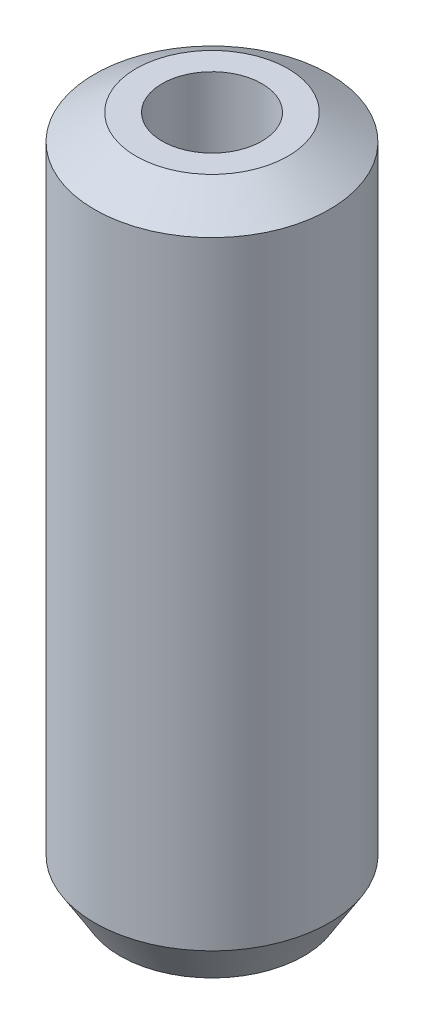
ISO-10303-21;
HEADER;
FILE_DESCRIPTION(('STEP AP214'),'2;1');
FILE_NAME('part.step','',(''),(''),'','','');
FILE_SCHEMA(('AUTOMOTIVE_DESIGN { 1 0 10303 214 1 1 1 1 }'));
ENDSEC;
DATA;
#1=APPLICATION_CONTEXT('core data for automotive mechanical design processes');
#2=APPLICATION_PROTOCOL_DEFINITION('international standard','automotive_design',2000,#1);
#3=PRODUCT_CONTEXT('',#1,'mechanical');
#4=PRODUCT('Part','Part','',(#3));
#5=PRODUCT_RELATED_PRODUCT_CATEGORY('part','',(#4));
#6=PRODUCT_DEFINITION_FORMATION('','',#4);
#7=PRODUCT_DEFINITION_CONTEXT('part definition',#1,'design');
#8=PRODUCT_DEFINITION('design','',#6,#7);
#9=PRODUCT_DEFINITION_SHAPE('','',#8);
#10=(LENGTH_UNIT() NAMED_UNIT(*) SI_UNIT(.MILLI.,.METRE.));
#11=(NAMED_UNIT(*) PLANE_ANGLE_UNIT() SI_UNIT($,.RADIAN.));
#12=(NAMED_UNIT(*) SI_UNIT($,.STERADIAN.) SOLID_ANGLE_UNIT());
#13=UNCERTAINTY_MEASURE_WITH_UNIT(LENGTH_MEASURE(1.E-05),#10,'distance_accuracy_value','');
#14=(GEOMETRIC_REPRESENTATION_CONTEXT(3) GLOBAL_UNCERTAINTY_ASSIGNED_CONTEXT((#13)) GLOBAL_UNIT_ASSIGNED_CONTEXT((#10,
#11,#12)) REPRESENTATION_CONTEXT('',''));
#15=CARTESIAN_POINT('',(0.,0.,0.));
#16=DIRECTION('',(0.,0.,1.));
#17=DIRECTION('',(1.,0.,0.));
#18=AXIS2_PLACEMENT_3D('',#15,#16,#17);
#19=CARTESIAN_POINT('',(0.,29.1641394386949,0.));
#20=DIRECTION('',(0.,-1.,0.));
#21=DIRECTION('',(0.,0.,-1.));
#22=AXIS2_PLACEMENT_3D('',#19,#20,#21);
#23=CYLINDRICAL_SURFACE('',#22,5.);
#24=CARTESIAN_POINT('',(0.,28.0793509885658,0.));
#25=DIRECTION('',(0.,1.,0.));
#26=DIRECTION('',(0.,0.,1.));
#27=AXIS2_PLACEMENT_3D('',#24,#25,#26);
#28=CIRCLE('',#27,5.);
#29=CARTESIAN_POINT('',(0.,28.0793509885658,-5.));
#30=VERTEX_POINT('',#29);
#31=EDGE_CURVE('E50',#30,#30,#28,.F.);
#32=CARTESIAN_POINT('',(0.,1.76536457793695,0.));
#33=DIRECTION('',(0.,1.,0.));
#34=DIRECTION('',(0.,0.,1.));
#35=AXIS2_PLACEMENT_3D('',#32,#33,#34);
#36=CIRCLE('',#35,5.);
#37=CARTESIAN_POINT('',(0.,1.76536457793694,-5.));
#38=VERTEX_POINT('',#37);
#39=EDGE_CURVE('E51',#38,#38,#36,.T.);
#40=CARTESIAN_POINT('',(0.,28.0793509885658,-5.));
#41=CARTESIAN_POINT('',(0.,27.8052469634551,-5.));
#42=CARTESIAN_POINT('',(0.,27.5311429383444,-5.));
#43=CARTESIAN_POINT('',(0.,26.982934888123,-5.));
#44=CARTESIAN_POINT('',(0.,26.7088308630122,-5.));
#45=CARTESIAN_POINT('',(0.,26.1606228127908,-5.));
#46=CARTESIAN_POINT('',(0.,25.8865187876801,-5.));
#47=CARTESIAN_POINT('',(0.,25.3383107374586,-5.));
#48=CARTESIAN_POINT('',(0.,25.0642067123479,-5.));
#49=CARTESIAN_POINT('',(0.,24.5159986621265,-5.));
#50=CARTESIAN_POINT('',(0.,24.2418946370158,-5.));
#51=CARTESIAN_POINT('',(0.,23.6936865867943,-5.));
#52=CARTESIAN_POINT('',(0.,23.4195825616836,-5.));
#53=CARTESIAN_POINT('',(0.,22.8713745114622,-5.));
#54=CARTESIAN_POINT('',(0.,22.5972704863515,-5.));
#55=CARTESIAN_POINT('',(0.,22.04906243613,-5.));
#56=CARTESIAN_POINT('',(0.,21.7749584110193,-5.));
#57=CARTESIAN_POINT('',(0.,21.2267503607979,-5.));
#58=CARTESIAN_POINT('',(0.,20.9526463356872,-5.));
#59=CARTESIAN_POINT('',(0.,20.4044382854657,-5.));
#60=CARTESIAN_POINT('',(0.,20.130334260355,-5.));
#61=CARTESIAN_POINT('',(0.,19.5821262101336,-5.));
#62=CARTESIAN_POINT('',(0.,19.3080221850229,-5.));
#63=CARTESIAN_POINT('',(0.,18.7598141348014,-5.));
#64=CARTESIAN_POINT('',(0.,18.4857101096907,-5.));
#65=CARTESIAN_POINT('',(0.,17.9375020594693,-5.));
#66=CARTESIAN_POINT('',(0.,17.6633980343586,-5.));
#67=CARTESIAN_POINT('',(0.,17.1151899841371,-5.));
#68=CARTESIAN_POINT('',(0.,16.8410859590264,-5.));
#69=CARTESIAN_POINT('',(0.,16.292877908805,-5.));
#70=CARTESIAN_POINT('',(0.,16.0187738836943,-5.));
#71=CARTESIAN_POINT('',(0.,15.4705658334728,-5.));
#72=CARTESIAN_POINT('',(0.,15.1964618083621,-5.));
#73=CARTESIAN_POINT('',(0.,14.6482537581407,-5.));
#74=CARTESIAN_POINT('',(0.,14.37414973303,-5.));
#75=CARTESIAN_POINT('',(0.,13.8259416828085,-5.));
#76=CARTESIAN_POINT('',(0.,13.5518376576978,-5.));
#77=CARTESIAN_POINT('',(0.,13.0036296074764,-5.));
#78=CARTESIAN_POINT('',(0.,12.7295255823656,-5.));
#79=CARTESIAN_POINT('',(0.,12.1813175321442,-5.));
#80=CARTESIAN_POINT('',(0.,11.9072135070335,-5.));
#81=CARTESIAN_POINT('',(0.,11.3590054568121,-5.));
#82=CARTESIAN_POINT('',(0.,11.0849014317013,-5.));
#83=CARTESIAN_POINT('',(0.,10.5366933814799,-5.));
#84=CARTESIAN_POINT('',(0.,10.2625893563692,-5.));
#85=CARTESIAN_POINT('',(0.,9.71438130614776,-5.));
#86=CARTESIAN_POINT('',(0.,9.44027728103704,-5.));
#87=CARTESIAN_POINT('',(0.,8.8920692308156,-5.));
#88=CARTESIAN_POINT('',(0.,8.61796520570488,-5.));
#89=CARTESIAN_POINT('',(0.,8.06975715548345,-5.));
#90=CARTESIAN_POINT('',(0.,7.79565313037273,-5.));
#91=CARTESIAN_POINT('',(0.,7.24744508015129,-5.));
#92=CARTESIAN_POINT('',(0.,6.97334105504058,-5.));
#93=CARTESIAN_POINT('',(0.,6.42513300481914,-5.));
#94=CARTESIAN_POINT('',(0.,6.15102897970842,-5.));
#95=CARTESIAN_POINT('',(0.,5.60282092948699,-5.));
#96=CARTESIAN_POINT('',(0.,5.32871690437627,-5.));
#97=CARTESIAN_POINT('',(0.,4.78050885415484,-5.));
#98=CARTESIAN_POINT('',(0.,4.50640482904412,-5.));
#99=CARTESIAN_POINT('',(0.,3.95819677882269,-5.));
#100=CARTESIAN_POINT('',(0.,3.68409275371197,-5.));
#101=CARTESIAN_POINT('',(0.,3.13588470349053,-5.));
#102=CARTESIAN_POINT('',(0.,2.86178067837982,-5.));
#103=CARTESIAN_POINT('',(0.,2.31357262815838,-5.));
#104=CARTESIAN_POINT('',(0.,2.03946860304766,-5.));
#105=CARTESIAN_POINT('',(0.,1.76536457793694,-5.));
#106=B_SPLINE_CURVE_WITH_KNOTS('',3,(#40,#41,#42,#43,#44,#45,#46,#47,#48,#49,#50,#51,#52,#53,
#54,#55,#56,#57,#58,#59,#60,#61,#62,#63,#64,#65,#66,#67,#68,#69,#70,#71,#72,#73,#74,#75,#76,#77,
#78,#79,#80,#81,#82,#83,#84,#85,#86,#87,#88,#89,#90,#91,#92,#93,#94,#95,#96,#97,#98,#99,#100,
#101,#102,#103,#104,#105),.UNSPECIFIED.,.F.,.F.,(4,2,2,2,2,2,2,2,2,2,2,2,2,2,2,2,2,2,2,2,2,2,2,
2,2,2,2,2,2,2,2,2,4),(0.,0.822312075332152,1.64462415066431,2.46693622599646,3.28924830132861,
4.11156037666076,4.93387245199292,5.75618452732507,6.57849660265722,7.40080867798937,
8.22312075332153,9.04543282865368,9.86774490398583,10.690056979318,11.5123690546501,
12.3346811299823,13.1569932053144,13.9793052806466,14.8016173559787,15.6239294313109,
16.446241506643,17.2685535819752,18.0908656573074,18.9131777326395,19.7354898079717,
20.5578018833038,21.380113958636,22.2024260339681,23.0247381093003,23.8470501846324,
24.6693622599646,25.4916743352967,26.3139864106289),.UNSPECIFIED.);
#107=EDGE_CURVE('BSEAM39',#30,#38,#106,.T.);
#108=ORIENTED_EDGE('',*,*,#31,.T.);
#109=ORIENTED_EDGE('',*,*,#39,.T.);
#110=ORIENTED_EDGE('',*,*,#107,.T.);
#111=ORIENTED_EDGE('',*,*,#107,.F.);
#112=EDGE_LOOP('',(#108,#110,#109,#111));
#113=FACE_BOUND('',#112,.T.);
#114=ADVANCED_FACE('F39',(#113),#23,.T.);
#115=CARTESIAN_POINT('',(0.,29.1641394386949,0.));
#116=DIRECTION('',(0.,1.,0.));
#117=DIRECTION('',(0.,0.,1.));
#118=AXIS2_PLACEMENT_3D('',#115,#116,#117);
#119=PLANE('',#118);
#120=CARTESIAN_POINT('',(0.,29.1641394386949,0.));
#121=DIRECTION('',(0.,1.,0.));
#122=DIRECTION('',(0.,0.,1.));
#123=AXIS2_PLACEMENT_3D('',#120,#121,#122);
#124=CIRCLE('',#123,3.23463542206308);
#125=CARTESIAN_POINT('',(0.,29.1641394386949,3.23463542206308));
#126=VERTEX_POINT('',#125);
#127=EDGE_CURVE('E54',#126,#126,#124,.T.);
#128=ORIENTED_EDGE('',*,*,#127,.T.);
#129=EDGE_LOOP('',(#128));
#130=FACE_BOUND('',#129,.T.);
#131=CARTESIAN_POINT('',(0.,29.1641394386949,0.));
#132=DIRECTION('',(0.,1.,0.));
#133=DIRECTION('',(0.,0.,1.));
#134=AXIS2_PLACEMENT_3D('',#131,#132,#133);
#135=CIRCLE('',#134,2.12451013846173);
#136=CARTESIAN_POINT('',(0.,29.1641394386949,-2.12451013846173));
#137=VERTEX_POINT('',#136);
#138=EDGE_CURVE('E58',#137,#137,#135,.T.);
#139=ORIENTED_EDGE('',*,*,#138,.F.);
#140=EDGE_LOOP('',(#139));
#141=FACE_BOUND('',#140,.T.);
#142=ADVANCED_FACE('F69',(#130,#141),#119,.T.);
#143=CARTESIAN_POINT('',(0.,0.,0.));
#144=DIRECTION('',(0.,1.,0.));
#145=DIRECTION('',(0.,0.,1.));
#146=AXIS2_PLACEMENT_3D('',#143,#144,#145);
#147=PLANE('',#146);
#148=CARTESIAN_POINT('',(0.,0.,0.));
#149=DIRECTION('',(0.,1.,0.));
#150=DIRECTION('',(0.,0.,1.));
#151=AXIS2_PLACEMENT_3D('',#148,#149,#150);
#152=CIRCLE('',#151,3.91521154987088);
#153=CARTESIAN_POINT('',(0.,0.,3.91521154987088));
#154=VERTEX_POINT('',#153);
#155=EDGE_CURVE('E10',#154,#154,#152,.F.);
#156=ORIENTED_EDGE('',*,*,#155,.T.);
#157=EDGE_LOOP('',(#156));
#158=FACE_BOUND('',#157,.T.);
#159=CARTESIAN_POINT('',(0.,0.,0.));
#160=DIRECTION('',(0.,1.,0.));
#161=DIRECTION('',(0.,0.,1.));
#162=AXIS2_PLACEMENT_3D('',#159,#160,#161);
#163=CIRCLE('',#162,2.12451013846173);
#164=CARTESIAN_POINT('',(0.,0.,-2.12451013846173));
#165=VERTEX_POINT('',#164);
#166=EDGE_CURVE('E63',#165,#165,#163,.T.);
#167=ORIENTED_EDGE('',*,*,#166,.T.);
#168=EDGE_LOOP('',(#167));
#169=FACE_BOUND('',#168,.T.);
#170=ADVANCED_FACE('F75',(#158,#169),#147,.F.);
#171=CARTESIAN_POINT('',(0.,29.1641394386949,0.));
#172=DIRECTION('',(0.,-1.,0.));
#173=DIRECTION('',(0.,0.,-1.));
#174=AXIS2_PLACEMENT_3D('',#171,#172,#173);
#175=CYLINDRICAL_SURFACE('',#174,2.12451013846173);
#176=CARTESIAN_POINT('',(0.,29.1641394386949,-2.12451013846173));
#177=CARTESIAN_POINT('',(0.,28.8603463195419,-2.12451013846173));
#178=CARTESIAN_POINT('',(0.,28.5565532003888,-2.12451013846173));
#179=CARTESIAN_POINT('',(0.,27.9489669620826,-2.12451013846173));
#180=CARTESIAN_POINT('',(0.,27.6451738429296,-2.12451013846173));
#181=CARTESIAN_POINT('',(0.,27.0375876046234,-2.12451013846173));
#182=CARTESIAN_POINT('',(0.,26.7337944854704,-2.12451013846173));
#183=CARTESIAN_POINT('',(0.,26.1262082471642,-2.12451013846173));
#184=CARTESIAN_POINT('',(0.,25.8224151280111,-2.12451013846173));
#185=CARTESIAN_POINT('',(0.,25.214828889705,-2.12451013846173));
#186=CARTESIAN_POINT('',(0.,24.9110357705519,-2.12451013846173));
#187=CARTESIAN_POINT('',(0.,24.3034495322458,-2.12451013846173));
#188=CARTESIAN_POINT('',(0.,23.9996564130927,-2.12451013846173));
#189=CARTESIAN_POINT('',(0.,23.3920701747866,-2.12451013846173));
#190=CARTESIAN_POINT('',(0.,23.0882770556335,-2.12451013846173));
#191=CARTESIAN_POINT('',(0.,22.4806908173273,-2.12451013846173));
#192=CARTESIAN_POINT('',(0.,22.1768976981743,-2.12451013846173));
#193=CARTESIAN_POINT('',(0.,21.5693114598681,-2.12451013846173));
#194=CARTESIAN_POINT('',(0.,21.2655183407151,-2.12451013846173));
#195=CARTESIAN_POINT('',(0.,20.6579321024089,-2.12451013846173));
#196=CARTESIAN_POINT('',(0.,20.3541389832558,-2.12451013846173));
#197=CARTESIAN_POINT('',(0.,19.7465527449497,-2.12451013846173));
#198=CARTESIAN_POINT('',(0.,19.4427596257966,-2.12451013846173));
#199=CARTESIAN_POINT('',(0.,18.8351733874905,-2.12451013846173));
#200=CARTESIAN_POINT('',(0.,18.5313802683374,-2.12451013846173));
#201=CARTESIAN_POINT('',(0.,17.9237940300313,-2.12451013846173));
#202=CARTESIAN_POINT('',(0.,17.6200009108782,-2.12451013846173));
#203=CARTESIAN_POINT('',(0.,17.012414672572,-2.12451013846173));
#204=CARTESIAN_POINT('',(0.,16.708621553419,-2.12451013846173));
#205=CARTESIAN_POINT('',(0.,16.1010353151128,-2.12451013846173));
#206=CARTESIAN_POINT('',(0.,15.7972421959598,-2.12451013846173));
#207=CARTESIAN_POINT('',(0.,15.1896559576536,-2.12451013846173));
#208=CARTESIAN_POINT('',(0.,14.8858628385005,-2.12451013846173));
#209=CARTESIAN_POINT('',(0.,14.2782766001944,-2.12451013846173));
#210=CARTESIAN_POINT('',(0.,13.9744834810413,-2.12451013846173));
#211=CARTESIAN_POINT('',(0.,13.3668972427352,-2.12451013846173));
#212=CARTESIAN_POINT('',(0.,13.0631041235821,-2.12451013846173));
#213=CARTESIAN_POINT('',(0.,12.455517885276,-2.12451013846173));
#214=CARTESIAN_POINT('',(0.,12.1517247661229,-2.12451013846173));
#215=CARTESIAN_POINT('',(0.,11.5441385278167,-2.12451013846173));
#216=CARTESIAN_POINT('',(0.,11.2403454086637,-2.12451013846173));
#217=CARTESIAN_POINT('',(0.,10.6327591703575,-2.12451013846173));
#218=CARTESIAN_POINT('',(0.,10.3289660512045,-2.12451013846173));
#219=CARTESIAN_POINT('',(0.,9.72137981289831,-2.12451013846173));
#220=CARTESIAN_POINT('',(0.,9.41758669374524,-2.12451013846173));
#221=CARTESIAN_POINT('',(0.,8.81000045543909,-2.12451013846173));
#222=CARTESIAN_POINT('',(0.,8.50620733628602,-2.12451013846173));
#223=CARTESIAN_POINT('',(0.,7.89862109797988,-2.12451013846173));
#224=CARTESIAN_POINT('',(0.,7.5948279788268,-2.12451013846173));
#225=CARTESIAN_POINT('',(0.,6.98724174052066,-2.12451013846173));
#226=CARTESIAN_POINT('',(0.,6.68344862136759,-2.12451013846173));
#227=CARTESIAN_POINT('',(0.,6.07586238306144,-2.12451013846173));
#228=CARTESIAN_POINT('',(0.,5.77206926390837,-2.12451013846173));
#229=CARTESIAN_POINT('',(0.,5.16448302560223,-2.12451013846173));
#230=CARTESIAN_POINT('',(0.,4.86068990644915,-2.12451013846173));
#231=CARTESIAN_POINT('',(0.,4.25310366814301,-2.12451013846173));
#232=CARTESIAN_POINT('',(0.,3.94931054898994,-2.12451013846173));
#233=CARTESIAN_POINT('',(0.,3.34172431068379,-2.12451013846173));
#234=CARTESIAN_POINT('',(0.,3.03793119153072,-2.12451013846173));
#235=CARTESIAN_POINT('',(0.,2.43034495322457,-2.12451013846173));
#236=CARTESIAN_POINT('',(0.,2.1265518340715,-2.12451013846173));
#237=CARTESIAN_POINT('',(0.,1.51896559576536,-2.12451013846173));
#238=CARTESIAN_POINT('',(0.,1.21517247661229,-2.12451013846173));
#239=CARTESIAN_POINT('',(0.,0.60758623830614,-2.12451013846173));
#240=CARTESIAN_POINT('',(0.,0.303793119153068,-2.12451013846173));
#241=CARTESIAN_POINT('',(0.,0.,-2.12451013846173));
#242=B_SPLINE_CURVE_WITH_KNOTS('',3,(#176,#177,#178,#179,#180,#181,#182,#183,#184,#185,#186,
#187,#188,#189,#190,#191,#192,#193,#194,#195,#196,#197,#198,#199,#200,#201,#202,#203,#204,#205,
#206,#207,#208,#209,#210,#211,#212,#213,#214,#215,#216,#217,#218,#219,#220,#221,#222,#223,#224,
#225,#226,#227,#228,#229,#230,#231,#232,#233,#234,#235,#236,#237,#238,#239,#240,#241),
.UNSPECIFIED.,.F.,.F.,(4,2,2,2,2,2,2,2,2,2,2,2,2,2,2,2,2,2,2,2,2,2,2,2,2,2,2,2,2,2,2,2,4),(0.,
0.911379357459219,1.82275871491843,2.73413807237765,3.64551742983687,4.55689678729609,
5.4682761447553,6.37965550221452,7.29103485967374,8.20241421713295,9.11379357459217,
10.0251729320514,10.9365522895106,11.8479316469698,12.759311004429,13.6706903618883,
14.5820697193475,15.4934490768067,16.4048284342659,17.3162077917251,18.2275871491843,
19.1389665066436,20.0503458641028,20.961725221562,21.8731045790212,22.7844839364804,
23.6958632939396,24.6072426513989,25.5186220088581,26.4300013663173,27.3413807237765,
28.2527600812357,29.1641394386949),.UNSPECIFIED.);
#243=EDGE_CURVE('BSEAM70',#137,#165,#242,.T.);
#244=ORIENTED_EDGE('',*,*,#138,.T.);
#245=ORIENTED_EDGE('',*,*,#166,.F.);
#246=ORIENTED_EDGE('',*,*,#243,.T.);
#247=ORIENTED_EDGE('',*,*,#243,.F.);
#248=EDGE_LOOP('',(#244,#246,#245,#247));
#249=FACE_BOUND('',#248,.T.);
#250=ADVANCED_FACE('F70',(#249),#175,.F.);
#251=CARTESIAN_POINT('',(0.,29.1641394386949,0.));
#252=DIRECTION('',(0.,-1.,0.));
#253=DIRECTION('',(0.,0.,-1.));
#254=AXIS2_PLACEMENT_3D('',#251,#252,#253);
#255=CONICAL_SURFACE('',#254,3.23463542206308,1.01979477597527);
#256=ORIENTED_EDGE('',*,*,#31,.F.);
#257=EDGE_LOOP('',(#256));
#258=FACE_BOUND('',#257,.T.);
#259=ORIENTED_EDGE('',*,*,#127,.F.);
#260=EDGE_LOOP('',(#259));
#261=FACE_BOUND('',#260,.T.);
#262=ADVANCED_FACE('F81',(#258,#261),#255,.T.);
#263=CARTESIAN_POINT('',(0.,1.76536457793695,0.));
#264=DIRECTION('',(0.,1.,0.));
#265=DIRECTION('',(0.,0.,1.));
#266=AXIS2_PLACEMENT_3D('',#263,#264,#265);
#267=CONICAL_SURFACE('',#266,5.,0.551001550819629);
#268=ORIENTED_EDGE('',*,*,#155,.F.);
#269=EDGE_LOOP('',(#268));
#270=FACE_BOUND('',#269,.T.);
#271=ORIENTED_EDGE('',*,*,#39,.F.);
#272=EDGE_LOOP('',(#271));
#273=FACE_BOUND('',#272,.T.);
#274=ADVANCED_FACE('F45',(#270,#273),#267,.T.);
#275=CLOSED_SHELL('',(#114,#142,#170,#250,#262,#274));
#276=MANIFOLD_SOLID_BREP('B2',#275);
#277=ADVANCED_BREP_SHAPE_REPRESENTATION('',(#18,#276),#14);
#278=SHAPE_DEFINITION_REPRESENTATION(#9,#277);
ENDSEC;
END-ISO-10303-21;
